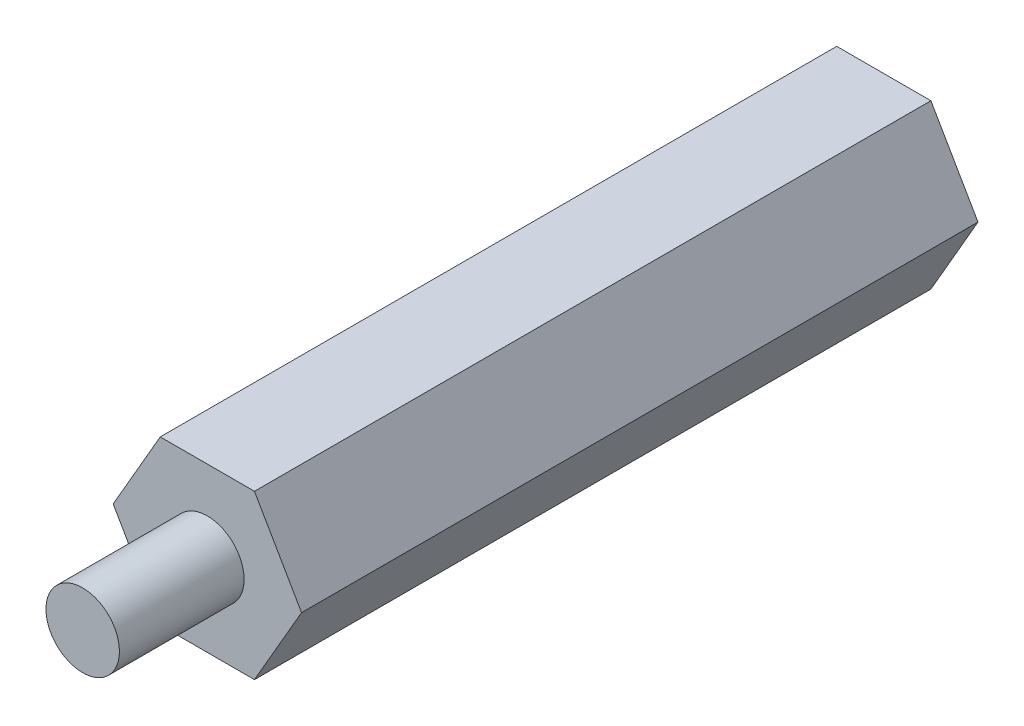
ISO-10303-21;
HEADER;
FILE_DESCRIPTION(('STEP AP214'),'2;1');
FILE_NAME('part.step','',(''),(''),'','','');
FILE_SCHEMA(('AUTOMOTIVE_DESIGN { 1 0 10303 214 1 1 1 1 }'));
ENDSEC;
DATA;
#1=APPLICATION_CONTEXT('core data for automotive mechanical design processes');
#2=APPLICATION_PROTOCOL_DEFINITION('international standard','automotive_design',2000,#1);
#3=PRODUCT_CONTEXT('',#1,'mechanical');
#4=PRODUCT('Part','Part','',(#3));
#5=PRODUCT_RELATED_PRODUCT_CATEGORY('part','',(#4));
#6=PRODUCT_DEFINITION_FORMATION('','',#4);
#7=PRODUCT_DEFINITION_CONTEXT('part definition',#1,'design');
#8=PRODUCT_DEFINITION('design','',#6,#7);
#9=PRODUCT_DEFINITION_SHAPE('','',#8);
#10=(LENGTH_UNIT() NAMED_UNIT(*) SI_UNIT(.MILLI.,.METRE.));
#11=(NAMED_UNIT(*) PLANE_ANGLE_UNIT() SI_UNIT($,.RADIAN.));
#12=(NAMED_UNIT(*) SI_UNIT($,.STERADIAN.) SOLID_ANGLE_UNIT());
#13=UNCERTAINTY_MEASURE_WITH_UNIT(LENGTH_MEASURE(1.E-05),#10,'distance_accuracy_value','');
#14=(GEOMETRIC_REPRESENTATION_CONTEXT(3) GLOBAL_UNCERTAINTY_ASSIGNED_CONTEXT((#13)) GLOBAL_UNIT_ASSIGNED_CONTEXT((#10,
#11,#12)) REPRESENTATION_CONTEXT('',''));
#15=CARTESIAN_POINT('',(0.,0.,0.));
#16=DIRECTION('',(0.,0.,1.));
#17=DIRECTION('',(1.,0.,0.));
#18=AXIS2_PLACEMENT_3D('',#15,#16,#17);
#19=CARTESIAN_POINT('',(0.,0.,25.5));
#20=DIRECTION('',(0.,0.,1.));
#21=DIRECTION('',(1.,0.,0.));
#22=AXIS2_PLACEMENT_3D('',#19,#20,#21);
#23=PLANE('',#22);
#24=DIRECTION('',(0.5,0.866025403784439,0.));
#25=VECTOR('',#24,1.);
#26=CARTESIAN_POINT('',(1.7753520777581,-3.075,25.5));
#27=LINE('',#26,#25);
#28=CARTESIAN_POINT('',(1.7753520777581,-3.075,25.5));
#29=VERTEX_POINT('',#28);
#30=CARTESIAN_POINT('',(3.5507041555162,0.,25.5));
#31=VERTEX_POINT('',#30);
#32=EDGE_CURVE('E156',#29,#31,#27,.T.);
#33=ORIENTED_EDGE('',*,*,#32,.T.);
#34=DIRECTION('',(-0.5,0.866025403784439,0.));
#35=VECTOR('',#34,1.);
#36=CARTESIAN_POINT('',(3.5507041555162,0.,25.5));
#37=LINE('',#36,#35);
#38=CARTESIAN_POINT('',(1.77535207775809,3.07500000000001,25.5));
#39=VERTEX_POINT('',#38);
#40=EDGE_CURVE('E102',#31,#39,#37,.T.);
#41=ORIENTED_EDGE('',*,*,#40,.T.);
#42=DIRECTION('',(-1.,0.,0.));
#43=VECTOR('',#42,1.);
#44=CARTESIAN_POINT('',(1.77535207775809,3.07500000000001,25.5));
#45=LINE('',#44,#43);
#46=CARTESIAN_POINT('',(-1.7753520777581,3.07500000000001,25.5));
#47=VERTEX_POINT('',#46);
#48=EDGE_CURVE('E117',#39,#47,#45,.T.);
#49=ORIENTED_EDGE('',*,*,#48,.T.);
#50=DIRECTION('',(-0.5,-0.866025403784439,0.));
#51=VECTOR('',#50,1.);
#52=CARTESIAN_POINT('',(-1.7753520777581,3.07500000000001,25.5));
#53=LINE('',#52,#51);
#54=CARTESIAN_POINT('',(-3.5507041555162,0.,25.5));
#55=VERTEX_POINT('',#54);
#56=EDGE_CURVE('E111',#47,#55,#53,.T.);
#57=ORIENTED_EDGE('',*,*,#56,.T.);
#58=DIRECTION('',(0.499999999999999,-0.866025403784439,0.));
#59=VECTOR('',#58,1.);
#60=CARTESIAN_POINT('',(-3.5507041555162,0.,25.5));
#61=LINE('',#60,#59);
#62=CARTESIAN_POINT('',(-1.7753520777581,-3.075,25.5));
#63=VERTEX_POINT('',#62);
#64=EDGE_CURVE('E115',#55,#63,#61,.T.);
#65=ORIENTED_EDGE('',*,*,#64,.T.);
#66=DIRECTION('',(1.,0.,0.));
#67=VECTOR('',#66,1.);
#68=CARTESIAN_POINT('',(-1.7753520777581,-3.075,25.5));
#69=LINE('',#68,#67);
#70=EDGE_CURVE('E60',#63,#29,#69,.T.);
#71=ORIENTED_EDGE('',*,*,#70,.T.);
#72=EDGE_LOOP('',(#33,#41,#49,#57,#65,#71));
#73=FACE_BOUND('',#72,.T.);
#74=CARTESIAN_POINT('',(0.,0.,25.5));
#75=DIRECTION('',(0.,0.,1.));
#76=DIRECTION('',(1.,0.,0.));
#77=AXIS2_PLACEMENT_3D('',#74,#75,#76);
#78=CIRCLE('',#77,1.385);
#79=CARTESIAN_POINT('',(1.385,0.,25.5));
#80=VERTEX_POINT('',#79);
#81=EDGE_CURVE('E211',#80,#80,#78,.T.);
#82=ORIENTED_EDGE('',*,*,#81,.F.);
#83=EDGE_LOOP('',(#82));
#84=FACE_BOUND('',#83,.T.);
#85=ADVANCED_FACE('F39',(#73,#84),#23,.T.);
#86=CARTESIAN_POINT('',(1.7753520777581,-3.075,25.5));
#87=DIRECTION('',(-0.866025403784439,0.5,0.));
#88=DIRECTION('',(-0.5,-0.866025403784439,0.));
#89=AXIS2_PLACEMENT_3D('',#86,#87,#88);
#90=PLANE('',#89);
#91=DIRECTION('',(0.5,0.866025403784439,0.));
#92=VECTOR('',#91,1.);
#93=CARTESIAN_POINT('',(1.7753520777581,-3.075,0.));
#94=LINE('',#93,#92);
#95=CARTESIAN_POINT('',(1.7753520777581,-3.075,0.));
#96=VERTEX_POINT('',#95);
#97=CARTESIAN_POINT('',(3.5507041555162,0.,0.));
#98=VERTEX_POINT('',#97);
#99=EDGE_CURVE('E140',#96,#98,#94,.T.);
#100=ORIENTED_EDGE('',*,*,#99,.T.);
#101=DIRECTION('',(0.,0.,-1.));
#102=VECTOR('',#101,1.);
#103=CARTESIAN_POINT('',(3.5507041555162,0.,25.5));
#104=LINE('',#103,#102);
#105=EDGE_CURVE('E11',#31,#98,#104,.T.);
#106=ORIENTED_EDGE('',*,*,#105,.F.);
#107=ORIENTED_EDGE('',*,*,#32,.F.);
#108=DIRECTION('',(0.,0.,-1.));
#109=VECTOR('',#108,1.);
#110=CARTESIAN_POINT('',(1.7753520777581,-3.075,25.5));
#111=LINE('',#110,#109);
#112=EDGE_CURVE('E136',#29,#96,#111,.T.);
#113=ORIENTED_EDGE('',*,*,#112,.T.);
#114=EDGE_LOOP('',(#100,#106,#107,#113));
#115=FACE_BOUND('',#114,.T.);
#116=ADVANCED_FACE('F41',(#115),#90,.F.);
#117=CARTESIAN_POINT('',(3.5507041555162,0.,25.5));
#118=DIRECTION('',(-0.866025403784439,-0.5,0.));
#119=DIRECTION('',(0.5,-0.866025403784439,0.));
#120=AXIS2_PLACEMENT_3D('',#117,#118,#119);
#121=PLANE('',#120);
#122=DIRECTION('',(-0.5,0.866025403784439,0.));
#123=VECTOR('',#122,1.);
#124=CARTESIAN_POINT('',(3.5507041555162,0.,0.));
#125=LINE('',#124,#123);
#126=CARTESIAN_POINT('',(1.77535207775809,3.07500000000001,0.));
#127=VERTEX_POINT('',#126);
#128=EDGE_CURVE('E144',#98,#127,#125,.T.);
#129=ORIENTED_EDGE('',*,*,#128,.T.);
#130=DIRECTION('',(0.,0.,-1.));
#131=VECTOR('',#130,1.);
#132=CARTESIAN_POINT('',(1.77535207775809,3.07500000000001,25.5));
#133=LINE('',#132,#131);
#134=EDGE_CURVE('E49',#39,#127,#133,.T.);
#135=ORIENTED_EDGE('',*,*,#134,.F.);
#136=ORIENTED_EDGE('',*,*,#40,.F.);
#137=ORIENTED_EDGE('',*,*,#105,.T.);
#138=EDGE_LOOP('',(#129,#135,#136,#137));
#139=FACE_BOUND('',#138,.T.);
#140=ADVANCED_FACE('F190',(#139),#121,.F.);
#141=CARTESIAN_POINT('',(1.77535207775809,3.07500000000001,25.5));
#142=DIRECTION('',(0.,-1.,0.));
#143=DIRECTION('',(1.,0.,0.));
#144=AXIS2_PLACEMENT_3D('',#141,#142,#143);
#145=PLANE('',#144);
#146=DIRECTION('',(-1.,0.,0.));
#147=VECTOR('',#146,1.);
#148=CARTESIAN_POINT('',(1.77535207775809,3.07500000000001,0.));
#149=LINE('',#148,#147);
#150=CARTESIAN_POINT('',(-1.7753520777581,3.07500000000001,0.));
#151=VERTEX_POINT('',#150);
#152=EDGE_CURVE('E148',#127,#151,#149,.T.);
#153=ORIENTED_EDGE('',*,*,#152,.T.);
#154=DIRECTION('',(0.,0.,-1.));
#155=VECTOR('',#154,1.);
#156=CARTESIAN_POINT('',(-1.7753520777581,3.07500000000001,25.5));
#157=LINE('',#156,#155);
#158=EDGE_CURVE('E128',#47,#151,#157,.T.);
#159=ORIENTED_EDGE('',*,*,#158,.F.);
#160=ORIENTED_EDGE('',*,*,#48,.F.);
#161=ORIENTED_EDGE('',*,*,#134,.T.);
#162=EDGE_LOOP('',(#153,#159,#160,#161));
#163=FACE_BOUND('',#162,.T.);
#164=ADVANCED_FACE('F167',(#163),#145,.F.);
#165=CARTESIAN_POINT('',(-1.7753520777581,3.07500000000001,25.5));
#166=DIRECTION('',(0.866025403784439,-0.5,0.));
#167=DIRECTION('',(0.5,0.866025403784439,0.));
#168=AXIS2_PLACEMENT_3D('',#165,#166,#167);
#169=PLANE('',#168);
#170=DIRECTION('',(-0.5,-0.866025403784439,0.));
#171=VECTOR('',#170,1.);
#172=CARTESIAN_POINT('',(-1.7753520777581,3.07500000000001,0.));
#173=LINE('',#172,#171);
#174=CARTESIAN_POINT('',(-3.5507041555162,0.,0.));
#175=VERTEX_POINT('',#174);
#176=EDGE_CURVE('E126',#151,#175,#173,.T.);
#177=ORIENTED_EDGE('',*,*,#176,.T.);
#178=DIRECTION('',(0.,0.,-1.));
#179=VECTOR('',#178,1.);
#180=CARTESIAN_POINT('',(-3.5507041555162,0.,25.5));
#181=LINE('',#180,#179);
#182=EDGE_CURVE('E123',#55,#175,#181,.T.);
#183=ORIENTED_EDGE('',*,*,#182,.F.);
#184=ORIENTED_EDGE('',*,*,#56,.F.);
#185=ORIENTED_EDGE('',*,*,#158,.T.);
#186=EDGE_LOOP('',(#177,#183,#184,#185));
#187=FACE_BOUND('',#186,.T.);
#188=ADVANCED_FACE('F124',(#187),#169,.F.);
#189=CARTESIAN_POINT('',(-3.5507041555162,0.,25.5));
#190=DIRECTION('',(0.866025403784439,0.499999999999999,0.));
#191=DIRECTION('',(-0.5,0.866025403784439,0.));
#192=AXIS2_PLACEMENT_3D('',#189,#190,#191);
#193=PLANE('',#192);
#194=DIRECTION('',(0.499999999999999,-0.866025403784439,0.));
#195=VECTOR('',#194,1.);
#196=CARTESIAN_POINT('',(-3.5507041555162,0.,0.));
#197=LINE('',#196,#195);
#198=CARTESIAN_POINT('',(-1.7753520777581,-3.075,0.));
#199=VERTEX_POINT('',#198);
#200=EDGE_CURVE('E86',#175,#199,#197,.T.);
#201=ORIENTED_EDGE('',*,*,#200,.T.);
#202=DIRECTION('',(0.,0.,-1.));
#203=VECTOR('',#202,1.);
#204=CARTESIAN_POINT('',(-1.7753520777581,-3.075,25.5));
#205=LINE('',#204,#203);
#206=EDGE_CURVE('E129',#63,#199,#205,.T.);
#207=ORIENTED_EDGE('',*,*,#206,.F.);
#208=ORIENTED_EDGE('',*,*,#64,.F.);
#209=ORIENTED_EDGE('',*,*,#182,.T.);
#210=EDGE_LOOP('',(#201,#207,#208,#209));
#211=FACE_BOUND('',#210,.T.);
#212=ADVANCED_FACE('F131',(#211),#193,.F.);
#213=CARTESIAN_POINT('',(-1.7753520777581,-3.075,25.5));
#214=DIRECTION('',(0.,1.,0.));
#215=DIRECTION('',(-1.,0.,0.));
#216=AXIS2_PLACEMENT_3D('',#213,#214,#215);
#217=PLANE('',#216);
#218=DIRECTION('',(1.,0.,0.));
#219=VECTOR('',#218,1.);
#220=CARTESIAN_POINT('',(-1.7753520777581,-3.075,0.));
#221=LINE('',#220,#219);
#222=EDGE_CURVE('E92',#199,#96,#221,.T.);
#223=ORIENTED_EDGE('',*,*,#222,.T.);
#224=ORIENTED_EDGE('',*,*,#112,.F.);
#225=ORIENTED_EDGE('',*,*,#70,.F.);
#226=ORIENTED_EDGE('',*,*,#206,.T.);
#227=EDGE_LOOP('',(#223,#224,#225,#226));
#228=FACE_BOUND('',#227,.T.);
#229=ADVANCED_FACE('F174',(#228),#217,.F.);
#230=CARTESIAN_POINT('',(0.,0.,0.));
#231=DIRECTION('',(0.,0.,1.));
#232=DIRECTION('',(1.,0.,0.));
#233=AXIS2_PLACEMENT_3D('',#230,#231,#232);
#234=PLANE('',#233);
#235=CARTESIAN_POINT('',(0.,0.,0.));
#236=DIRECTION('',(0.,0.,-1.));
#237=DIRECTION('',(-1.,0.,0.));
#238=AXIS2_PLACEMENT_3D('',#235,#236,#237);
#239=CIRCLE('',#238,1.35);
#240=CARTESIAN_POINT('',(-1.35,0.,0.));
#241=VERTEX_POINT('',#240);
#242=EDGE_CURVE('E212',#241,#241,#239,.T.);
#243=ORIENTED_EDGE('',*,*,#242,.F.);
#244=EDGE_LOOP('',(#243));
#245=FACE_BOUND('',#244,.T.);
#246=ORIENTED_EDGE('',*,*,#99,.F.);
#247=ORIENTED_EDGE('',*,*,#222,.F.);
#248=ORIENTED_EDGE('',*,*,#200,.F.);
#249=ORIENTED_EDGE('',*,*,#176,.F.);
#250=ORIENTED_EDGE('',*,*,#152,.F.);
#251=ORIENTED_EDGE('',*,*,#128,.F.);
#252=EDGE_LOOP('',(#246,#247,#248,#249,#250,#251));
#253=FACE_BOUND('',#252,.T.);
#254=ADVANCED_FACE('F170',(#245,#253),#234,.F.);
#255=CARTESIAN_POINT('',(0.,0.,30.2));
#256=DIRECTION('',(0.,0.,-1.));
#257=DIRECTION('',(-1.,0.,0.));
#258=AXIS2_PLACEMENT_3D('',#255,#256,#257);
#259=CYLINDRICAL_SURFACE('',#258,1.385);
#260=CARTESIAN_POINT('',(0.,0.,30.2));
#261=DIRECTION('',(0.,0.,1.));
#262=DIRECTION('',(1.,0.,0.));
#263=AXIS2_PLACEMENT_3D('',#260,#261,#262);
#264=CIRCLE('',#263,1.385);
#265=CARTESIAN_POINT('',(1.385,0.,30.2));
#266=VERTEX_POINT('',#265);
#267=EDGE_CURVE('E145',#266,#266,#264,.T.);
#268=ORIENTED_EDGE('',*,*,#267,.F.);
#269=EDGE_LOOP('',(#268));
#270=FACE_BOUND('',#269,.T.);
#271=ORIENTED_EDGE('',*,*,#81,.T.);
#272=EDGE_LOOP('',(#271));
#273=FACE_BOUND('',#272,.T.);
#274=ADVANCED_FACE('F181',(#270,#273),#259,.T.);
#275=CARTESIAN_POINT('',(0.,0.,30.2));
#276=DIRECTION('',(0.,0.,1.));
#277=DIRECTION('',(1.,0.,0.));
#278=AXIS2_PLACEMENT_3D('',#275,#276,#277);
#279=PLANE('',#278);
#280=ORIENTED_EDGE('',*,*,#267,.T.);
#281=EDGE_LOOP('',(#280));
#282=FACE_BOUND('',#281,.T.);
#283=ADVANCED_FACE('F194',(#282),#279,.T.);
#284=CARTESIAN_POINT('',(0.,0.,4.7));
#285=DIRECTION('',(0.,0.,-1.));
#286=DIRECTION('',(-1.,0.,0.));
#287=AXIS2_PLACEMENT_3D('',#284,#285,#286);
#288=CYLINDRICAL_SURFACE('',#287,1.35);
#289=CARTESIAN_POINT('',(0.,0.,4.7));
#290=DIRECTION('',(0.,0.,-1.));
#291=DIRECTION('',(-1.,0.,0.));
#292=AXIS2_PLACEMENT_3D('',#289,#290,#291);
#293=CIRCLE('',#292,1.35);
#294=CARTESIAN_POINT('',(-1.35,0.,4.7));
#295=VERTEX_POINT('',#294);
#296=EDGE_CURVE('E210',#295,#295,#293,.T.);
#297=ORIENTED_EDGE('',*,*,#296,.F.);
#298=EDGE_LOOP('',(#297));
#299=FACE_BOUND('',#298,.T.);
#300=ORIENTED_EDGE('',*,*,#242,.T.);
#301=EDGE_LOOP('',(#300));
#302=FACE_BOUND('',#301,.T.);
#303=ADVANCED_FACE('F198',(#299,#302),#288,.F.);
#304=CARTESIAN_POINT('',(0.,0.,4.7));
#305=DIRECTION('',(0.,0.,-1.));
#306=DIRECTION('',(-1.,0.,0.));
#307=AXIS2_PLACEMENT_3D('',#304,#305,#306);
#308=PLANE('',#307);
#309=ORIENTED_EDGE('',*,*,#296,.T.);
#310=EDGE_LOOP('',(#309));
#311=FACE_BOUND('',#310,.T.);
#312=ADVANCED_FACE('F202',(#311),#308,.T.);
#313=CLOSED_SHELL('',(#85,#116,#140,#164,#188,#212,#229,#254,#274,#283,#303,#312));
#314=MANIFOLD_SOLID_BREP('B2',#313);
#315=ADVANCED_BREP_SHAPE_REPRESENTATION('',(#18,#314),#14);
#316=SHAPE_DEFINITION_REPRESENTATION(#9,#315);
ENDSEC;
END-ISO-10303-21;
